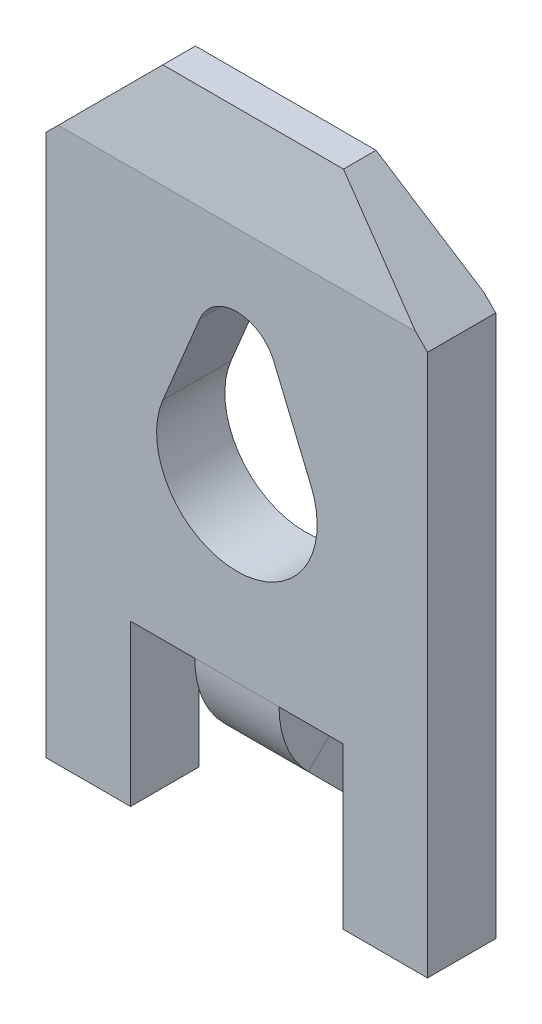
ISO-10303-21;
HEADER;
FILE_DESCRIPTION(('STEP AP214'),'2;1');
FILE_NAME('part.step','',(''),(''),'','','');
FILE_SCHEMA(('AUTOMOTIVE_DESIGN { 1 0 10303 214 1 1 1 1 }'));
ENDSEC;
DATA;
#1=APPLICATION_CONTEXT('core data for automotive mechanical design processes');
#2=APPLICATION_PROTOCOL_DEFINITION('international standard','automotive_design',2000,#1);
#3=PRODUCT_CONTEXT('',#1,'mechanical');
#4=PRODUCT('Part','Part','',(#3));
#5=PRODUCT_RELATED_PRODUCT_CATEGORY('part','',(#4));
#6=PRODUCT_DEFINITION_FORMATION('','',#4);
#7=PRODUCT_DEFINITION_CONTEXT('part definition',#1,'design');
#8=PRODUCT_DEFINITION('design','',#6,#7);
#9=PRODUCT_DEFINITION_SHAPE('','',#8);
#10=(LENGTH_UNIT() NAMED_UNIT(*) SI_UNIT(.MILLI.,.METRE.));
#11=(NAMED_UNIT(*) PLANE_ANGLE_UNIT() SI_UNIT($,.RADIAN.));
#12=(NAMED_UNIT(*) SI_UNIT($,.STERADIAN.) SOLID_ANGLE_UNIT());
#13=UNCERTAINTY_MEASURE_WITH_UNIT(LENGTH_MEASURE(1.E-05),#10,'distance_accuracy_value','');
#14=(GEOMETRIC_REPRESENTATION_CONTEXT(3) GLOBAL_UNCERTAINTY_ASSIGNED_CONTEXT((#13)) GLOBAL_UNIT_ASSIGNED_CONTEXT((#10,
#11,#12)) REPRESENTATION_CONTEXT('',''));
#15=CARTESIAN_POINT('',(0.,0.,0.));
#16=DIRECTION('',(0.,0.,1.));
#17=DIRECTION('',(1.,0.,0.));
#18=AXIS2_PLACEMENT_3D('',#15,#16,#17);
#19=CARTESIAN_POINT('',(4.75,0.149999999999999,0.));
#20=DIRECTION('',(0.,0.,1.));
#21=DIRECTION('',(0.,-1.,0.));
#22=AXIS2_PLACEMENT_3D('',#19,#20,#21);
#23=PLANE('',#22);
#24=DIRECTION('',(0.384813689288076,-0.922994271128754,0.));
#25=VECTOR('',#24,1.);
#26=CARTESIAN_POINT('',(2.84243697464802,5.82748992853653,0.));
#27=LINE('',#26,#25);
#28=CARTESIAN_POINT('',(2.84243697464802,5.82748992853653,0.));
#29=VERTEX_POINT('',#28);
#30=CARTESIAN_POINT('',(3.29799427112875,4.73481368928808,0.));
#31=VERTEX_POINT('',#30);
#32=EDGE_CURVE('E273',#29,#31,#27,.T.);
#33=ORIENTED_EDGE('',*,*,#32,.F.);
#34=CARTESIAN_POINT('',(2.375,5.65,0.));
#35=DIRECTION('',(0.,0.,1.));
#36=DIRECTION('',(0.,-1.,0.));
#37=AXIS2_PLACEMENT_3D('',#34,#35,#36);
#38=CIRCLE('',#37,0.5);
#39=CARTESIAN_POINT('',(1.91346153846154,5.84230769230769,0.));
#40=VERTEX_POINT('',#39);
#41=EDGE_CURVE('E276',#40,#29,#38,.F.);
#42=ORIENTED_EDGE('',*,*,#41,.F.);
#43=DIRECTION('',(0.384615384615385,0.923076923076923,0.));
#44=VECTOR('',#43,1.);
#45=CARTESIAN_POINT('',(1.91346153846154,5.84230769230769,0.));
#46=LINE('',#45,#44);
#47=CARTESIAN_POINT('',(1.45192307692308,4.73461538461538,0.));
#48=VERTEX_POINT('',#47);
#49=EDGE_CURVE('E278',#48,#40,#46,.T.);
#50=ORIENTED_EDGE('',*,*,#49,.F.);
#51=CARTESIAN_POINT('',(2.375,4.35,0.));
#52=DIRECTION('',(0.,0.,1.));
#53=DIRECTION('',(0.,-1.,0.));
#54=AXIS2_PLACEMENT_3D('',#51,#52,#53);
#55=CIRCLE('',#54,1.);
#56=EDGE_CURVE('E270',#31,#48,#55,.F.);
#57=ORIENTED_EDGE('',*,*,#56,.F.);
#58=EDGE_LOOP('',(#33,#42,#50,#57));
#59=FACE_BOUND('',#58,.T.);
#60=DIRECTION('',(1.,0.,0.));
#61=VECTOR('',#60,1.);
#62=CARTESIAN_POINT('',(2.9,2.15,0.));
#63=LINE('',#62,#61);
#64=CARTESIAN_POINT('',(2.9,2.15,0.));
#65=VERTEX_POINT('',#64);
#66=CARTESIAN_POINT('',(3.7,2.15,0.));
#67=VERTEX_POINT('',#66);
#68=EDGE_CURVE('E238',#65,#67,#63,.T.);
#69=ORIENTED_EDGE('',*,*,#68,.F.);
#70=DIRECTION('',(-1.,0.,0.));
#71=VECTOR('',#70,1.);
#72=CARTESIAN_POINT('',(4.75,2.15,0.));
#73=LINE('',#72,#71);
#74=CARTESIAN_POINT('',(1.85,2.15,0.));
#75=VERTEX_POINT('',#74);
#76=EDGE_CURVE('E51',#65,#75,#73,.T.);
#77=ORIENTED_EDGE('',*,*,#76,.T.);
#78=DIRECTION('',(1.,0.,0.));
#79=VECTOR('',#78,1.);
#80=CARTESIAN_POINT('',(1.85,2.15,0.));
#81=LINE('',#80,#79);
#82=CARTESIAN_POINT('',(1.05,2.15,0.));
#83=VERTEX_POINT('',#82);
#84=EDGE_CURVE('E249',#83,#75,#81,.T.);
#85=ORIENTED_EDGE('',*,*,#84,.F.);
#86=DIRECTION('',(0.,1.,0.));
#87=VECTOR('',#86,1.);
#88=CARTESIAN_POINT('',(1.05,2.15,0.));
#89=LINE('',#88,#87);
#90=CARTESIAN_POINT('',(1.05,0.149999999999999,0.));
#91=VERTEX_POINT('',#90);
#92=EDGE_CURVE('E247',#91,#83,#89,.T.);
#93=ORIENTED_EDGE('',*,*,#92,.F.);
#94=DIRECTION('',(-1.,0.,0.));
#95=VECTOR('',#94,1.);
#96=CARTESIAN_POINT('',(4.75,0.149999999999999,0.));
#97=LINE('',#96,#95);
#98=CARTESIAN_POINT('',(0.,0.149999999999999,0.));
#99=VERTEX_POINT('',#98);
#100=EDGE_CURVE('E347',#91,#99,#97,.T.);
#101=ORIENTED_EDGE('',*,*,#100,.T.);
#102=DIRECTION('',(0.,1.,0.));
#103=VECTOR('',#102,1.);
#104=CARTESIAN_POINT('',(0.,0.149999999999999,0.));
#105=LINE('',#104,#103);
#106=CARTESIAN_POINT('',(0.,6.9,0.));
#107=VERTEX_POINT('',#106);
#108=EDGE_CURVE('E332',#99,#107,#105,.T.);
#109=ORIENTED_EDGE('',*,*,#108,.T.);
#110=DIRECTION('',(-0.707106781186548,-0.707106781186548,0.));
#111=VECTOR('',#110,1.);
#112=CARTESIAN_POINT('',(0.,6.9,0.));
#113=LINE('',#112,#111);
#114=CARTESIAN_POINT('',(0.15,7.05,0.));
#115=VERTEX_POINT('',#114);
#116=EDGE_CURVE('E306',#115,#107,#113,.T.);
#117=ORIENTED_EDGE('',*,*,#116,.F.);
#118=DIRECTION('',(-1.,0.,0.));
#119=VECTOR('',#118,1.);
#120=CARTESIAN_POINT('',(4.75,7.05,0.));
#121=LINE('',#120,#119);
#122=CARTESIAN_POINT('',(4.6,7.05,0.));
#123=VERTEX_POINT('',#122);
#124=EDGE_CURVE('E337',#123,#115,#121,.T.);
#125=ORIENTED_EDGE('',*,*,#124,.F.);
#126=DIRECTION('',(-0.707106781186548,0.707106781186548,0.));
#127=VECTOR('',#126,1.);
#128=CARTESIAN_POINT('',(3.5,8.15,0.));
#129=LINE('',#128,#127);
#130=CARTESIAN_POINT('',(4.75,6.9,0.));
#131=VERTEX_POINT('',#130);
#132=EDGE_CURVE('E302',#131,#123,#129,.T.);
#133=ORIENTED_EDGE('',*,*,#132,.F.);
#134=DIRECTION('',(0.,1.,0.));
#135=VECTOR('',#134,1.);
#136=CARTESIAN_POINT('',(4.75,0.149999999999999,0.));
#137=LINE('',#136,#135);
#138=CARTESIAN_POINT('',(4.75,0.149999999999999,0.));
#139=VERTEX_POINT('',#138);
#140=EDGE_CURVE('E334',#139,#131,#137,.T.);
#141=ORIENTED_EDGE('',*,*,#140,.F.);
#142=CARTESIAN_POINT('',(3.7,0.149999999999999,0.));
#143=VERTEX_POINT('',#142);
#144=EDGE_CURVE('E348',#139,#143,#97,.T.);
#145=ORIENTED_EDGE('',*,*,#144,.T.);
#146=DIRECTION('',(0.,-1.,0.));
#147=VECTOR('',#146,1.);
#148=CARTESIAN_POINT('',(3.7,2.15,0.));
#149=LINE('',#148,#147);
#150=EDGE_CURVE('E262',#67,#143,#149,.T.);
#151=ORIENTED_EDGE('',*,*,#150,.F.);
#152=EDGE_LOOP('',(#69,#77,#85,#93,#101,#109,#117,#125,#133,#141,#145,#151));
#153=FACE_BOUND('',#152,.T.);
#154=ADVANCED_FACE('F44',(#59,#153),#23,.F.);
#155=CARTESIAN_POINT('',(4.75,7.05,0.85));
#156=DIRECTION('',(0.,0.,-1.));
#157=DIRECTION('',(0.,1.,0.));
#158=AXIS2_PLACEMENT_3D('',#155,#156,#157);
#159=PLANE('',#158);
#160=DIRECTION('',(-0.384615384615385,-0.923076923076923,0.));
#161=VECTOR('',#160,1.);
#162=CARTESIAN_POINT('',(1.91346153846154,5.84230769230769,0.849999999999999));
#163=LINE('',#162,#161);
#164=CARTESIAN_POINT('',(1.91346153846154,5.84230769230769,0.85));
#165=VERTEX_POINT('',#164);
#166=CARTESIAN_POINT('',(1.45192307692308,4.73461538461538,0.849999999999999));
#167=VERTEX_POINT('',#166);
#168=EDGE_CURVE('E280',#165,#167,#163,.T.);
#169=ORIENTED_EDGE('',*,*,#168,.F.);
#170=CARTESIAN_POINT('',(2.375,5.65,0.849999999999999));
#171=DIRECTION('',(0.,0.,1.));
#172=DIRECTION('',(1.,0.,0.));
#173=AXIS2_PLACEMENT_3D('',#170,#171,#172);
#174=CIRCLE('',#173,0.5);
#175=CARTESIAN_POINT('',(2.84243697464802,5.82748992853653,0.849999999999999));
#176=VERTEX_POINT('',#175);
#177=EDGE_CURVE('E256',#176,#165,#174,.T.);
#178=ORIENTED_EDGE('',*,*,#177,.F.);
#179=DIRECTION('',(-0.384813689288076,0.922994271128754,0.));
#180=VECTOR('',#179,1.);
#181=CARTESIAN_POINT('',(2.84243697464802,5.82748992853653,0.849999999999999));
#182=LINE('',#181,#180);
#183=CARTESIAN_POINT('',(3.29799427112875,4.73481368928808,0.849999999999999));
#184=VERTEX_POINT('',#183);
#185=EDGE_CURVE('E286',#184,#176,#182,.T.);
#186=ORIENTED_EDGE('',*,*,#185,.F.);
#187=CARTESIAN_POINT('',(2.375,4.35,0.849999999999999));
#188=DIRECTION('',(0.,0.,1.));
#189=DIRECTION('',(1.,0.,0.));
#190=AXIS2_PLACEMENT_3D('',#187,#188,#189);
#191=CIRCLE('',#190,1.);
#192=EDGE_CURVE('E283',#167,#184,#191,.T.);
#193=ORIENTED_EDGE('',*,*,#192,.F.);
#194=EDGE_LOOP('',(#169,#178,#186,#193));
#195=FACE_BOUND('',#194,.T.);
#196=DIRECTION('',(-1.,0.,0.));
#197=VECTOR('',#196,1.);
#198=CARTESIAN_POINT('',(1.85,2.15,0.85));
#199=LINE('',#198,#197);
#200=CARTESIAN_POINT('',(1.85,2.15,0.85));
#201=VERTEX_POINT('',#200);
#202=CARTESIAN_POINT('',(1.05,2.15,0.85));
#203=VERTEX_POINT('',#202);
#204=EDGE_CURVE('E243',#201,#203,#199,.T.);
#205=ORIENTED_EDGE('',*,*,#204,.F.);
#206=DIRECTION('',(1.,0.,0.));
#207=VECTOR('',#206,1.);
#208=CARTESIAN_POINT('',(4.75,2.15,0.849999999999999));
#209=LINE('',#208,#207);
#210=CARTESIAN_POINT('',(2.9,2.15,0.849999999999999));
#211=VERTEX_POINT('',#210);
#212=EDGE_CURVE('E364',#201,#211,#209,.T.);
#213=ORIENTED_EDGE('',*,*,#212,.T.);
#214=DIRECTION('',(-1.,0.,0.));
#215=VECTOR('',#214,1.);
#216=CARTESIAN_POINT('',(2.9,2.15,0.85));
#217=LINE('',#216,#215);
#218=CARTESIAN_POINT('',(3.7,2.15,0.85));
#219=VERTEX_POINT('',#218);
#220=EDGE_CURVE('E250',#219,#211,#217,.T.);
#221=ORIENTED_EDGE('',*,*,#220,.F.);
#222=DIRECTION('',(0.,1.,0.));
#223=VECTOR('',#222,1.);
#224=CARTESIAN_POINT('',(3.7,2.15,0.85));
#225=LINE('',#224,#223);
#226=CARTESIAN_POINT('',(3.7,0.149999999999999,0.849999999999999));
#227=VERTEX_POINT('',#226);
#228=EDGE_CURVE('E257',#227,#219,#225,.T.);
#229=ORIENTED_EDGE('',*,*,#228,.F.);
#230=DIRECTION('',(-1.,0.,0.));
#231=VECTOR('',#230,1.);
#232=CARTESIAN_POINT('',(4.75,0.149999999999999,0.849999999999999));
#233=LINE('',#232,#231);
#234=CARTESIAN_POINT('',(4.75,0.149999999999999,0.849999999999999));
#235=VERTEX_POINT('',#234);
#236=EDGE_CURVE('E352',#235,#227,#233,.T.);
#237=ORIENTED_EDGE('',*,*,#236,.F.);
#238=DIRECTION('',(0.,-1.,0.));
#239=VECTOR('',#238,1.);
#240=CARTESIAN_POINT('',(4.75,7.05,0.85));
#241=LINE('',#240,#239);
#242=CARTESIAN_POINT('',(4.75,6.9,0.85));
#243=VERTEX_POINT('',#242);
#244=EDGE_CURVE('E329',#243,#235,#241,.T.);
#245=ORIENTED_EDGE('',*,*,#244,.F.);
#246=DIRECTION('',(0.707106781186548,-0.707106781186548,0.));
#247=VECTOR('',#246,1.);
#248=CARTESIAN_POINT('',(3.5,8.15,0.849999999999999));
#249=LINE('',#248,#247);
#250=CARTESIAN_POINT('',(4.6,7.05,0.849999999999999));
#251=VERTEX_POINT('',#250);
#252=EDGE_CURVE('E298',#251,#243,#249,.T.);
#253=ORIENTED_EDGE('',*,*,#252,.F.);
#254=DIRECTION('',(-1.,0.,0.));
#255=VECTOR('',#254,1.);
#256=CARTESIAN_POINT('',(4.75,7.05,0.85));
#257=LINE('',#256,#255);
#258=CARTESIAN_POINT('',(0.15,7.05,0.849999999999999));
#259=VERTEX_POINT('',#258);
#260=EDGE_CURVE('E355',#251,#259,#257,.T.);
#261=ORIENTED_EDGE('',*,*,#260,.T.);
#262=DIRECTION('',(0.707106781186547,0.707106781186548,0.));
#263=VECTOR('',#262,1.);
#264=CARTESIAN_POINT('',(0.,6.9,0.849999999999999));
#265=LINE('',#264,#263);
#266=CARTESIAN_POINT('',(0.,6.9,0.849999999999999));
#267=VERTEX_POINT('',#266);
#268=EDGE_CURVE('E299',#267,#259,#265,.T.);
#269=ORIENTED_EDGE('',*,*,#268,.F.);
#270=DIRECTION('',(0.,-1.,0.));
#271=VECTOR('',#270,1.);
#272=CARTESIAN_POINT('',(0.,7.05,0.85));
#273=LINE('',#272,#271);
#274=CARTESIAN_POINT('',(0.,0.149999999999999,0.849999999999999));
#275=VERTEX_POINT('',#274);
#276=EDGE_CURVE('E328',#267,#275,#273,.T.);
#277=ORIENTED_EDGE('',*,*,#276,.T.);
#278=CARTESIAN_POINT('',(1.05,0.149999999999999,0.849999999999999));
#279=VERTEX_POINT('',#278);
#280=EDGE_CURVE('E351',#279,#275,#233,.T.);
#281=ORIENTED_EDGE('',*,*,#280,.F.);
#282=DIRECTION('',(0.,-1.,0.));
#283=VECTOR('',#282,1.);
#284=CARTESIAN_POINT('',(1.05,2.15,0.85));
#285=LINE('',#284,#283);
#286=EDGE_CURVE('E245',#203,#279,#285,.T.);
#287=ORIENTED_EDGE('',*,*,#286,.F.);
#288=EDGE_LOOP('',(#205,#213,#221,#229,#237,#245,#253,#261,#269,#277,#281,#287));
#289=FACE_BOUND('',#288,.T.);
#290=ADVANCED_FACE('F384',(#195,#289),#159,.F.);
#291=CARTESIAN_POINT('',(4.75,0.149999999999999,0.));
#292=DIRECTION('',(0.,1.,0.));
#293=DIRECTION('',(0.,0.,1.));
#294=AXIS2_PLACEMENT_3D('',#291,#292,#293);
#295=PLANE('',#294);
#296=ORIENTED_EDGE('',*,*,#100,.F.);
#297=DIRECTION('',(0.,0.,-1.));
#298=VECTOR('',#297,1.);
#299=CARTESIAN_POINT('',(1.05,0.149999999999999,3.0040659228538));
#300=LINE('',#299,#298);
#301=EDGE_CURVE('E65',#279,#91,#300,.T.);
#302=ORIENTED_EDGE('',*,*,#301,.F.);
#303=ORIENTED_EDGE('',*,*,#280,.T.);
#304=DIRECTION('',(0.,0.,-1.));
#305=VECTOR('',#304,1.);
#306=CARTESIAN_POINT('',(0.,0.149999999999999,0.));
#307=LINE('',#306,#305);
#308=EDGE_CURVE('E340',#275,#99,#307,.T.);
#309=ORIENTED_EDGE('',*,*,#308,.T.);
#310=EDGE_LOOP('',(#296,#302,#303,#309));
#311=FACE_BOUND('',#310,.T.);
#312=ADVANCED_FACE('F419',(#311),#295,.F.);
#313=CARTESIAN_POINT('',(4.75,7.05,0.));
#314=DIRECTION('',(0.,-0.214348018272916,0.976757353216485));
#315=DIRECTION('',(0.,-0.976757353216485,-0.214348018272916));
#316=AXIS2_PLACEMENT_3D('',#313,#314,#315);
#317=PLANE('',#316);
#318=ORIENTED_EDGE('',*,*,#124,.T.);
#319=DIRECTION('',(0.698744344369524,0.698744344369524,0.153338457091523));
#320=VECTOR('',#319,1.);
#321=CARTESIAN_POINT('',(2.39592083042662,9.29592083042662,0.492864146468432));
#322=LINE('',#321,#320);
#323=CARTESIAN_POINT('',(1.25,8.15,0.241393442622949));
#324=VERTEX_POINT('',#323);
#325=EDGE_CURVE('E319',#115,#324,#322,.T.);
#326=ORIENTED_EDGE('',*,*,#325,.T.);
#327=DIRECTION('',(-1.,0.,0.));
#328=VECTOR('',#327,1.);
#329=CARTESIAN_POINT('',(4.75,8.15,0.241393442622949));
#330=LINE('',#329,#328);
#331=CARTESIAN_POINT('',(3.5,8.15,0.241393442622949));
#332=VERTEX_POINT('',#331);
#333=EDGE_CURVE('E361',#332,#324,#330,.T.);
#334=ORIENTED_EDGE('',*,*,#333,.F.);
#335=DIRECTION('',(0.698744344369524,-0.698744344369524,-0.153338457091523));
#336=VECTOR('',#335,1.);
#337=CARTESIAN_POINT('',(4.67323654881826,6.97676345118174,-0.0160716569500576));
#338=LINE('',#337,#336);
#339=EDGE_CURVE('E325',#332,#123,#338,.T.);
#340=ORIENTED_EDGE('',*,*,#339,.T.);
#341=EDGE_LOOP('',(#318,#326,#334,#340));
#342=FACE_BOUND('',#341,.T.);
#343=ADVANCED_FACE('F481',(#342),#317,.F.);
#344=CARTESIAN_POINT('',(4.75,8.15,0.241393442622949));
#345=DIRECTION('',(0.,-1.,0.));
#346=DIRECTION('',(0.,0.,-1.));
#347=AXIS2_PLACEMENT_3D('',#344,#345,#346);
#348=PLANE('',#347);
#349=ORIENTED_EDGE('',*,*,#333,.T.);
#350=DIRECTION('',(0.,0.,1.));
#351=VECTOR('',#350,1.);
#352=CARTESIAN_POINT('',(1.25,8.15,-1.76776695296637));
#353=LINE('',#352,#351);
#354=CARTESIAN_POINT('',(1.25,8.15,0.647131147540979));
#355=VERTEX_POINT('',#354);
#356=EDGE_CURVE('E303',#324,#355,#353,.T.);
#357=ORIENTED_EDGE('',*,*,#356,.T.);
#358=DIRECTION('',(-1.,0.,0.));
#359=VECTOR('',#358,1.);
#360=CARTESIAN_POINT('',(4.75,8.15,0.647131147540979));
#361=LINE('',#360,#359);
#362=CARTESIAN_POINT('',(3.5,8.15,0.647131147540979));
#363=VERTEX_POINT('',#362);
#364=EDGE_CURVE('E358',#363,#355,#361,.T.);
#365=ORIENTED_EDGE('',*,*,#364,.F.);
#366=DIRECTION('',(0.,0.,1.));
#367=VECTOR('',#366,1.);
#368=CARTESIAN_POINT('',(3.5,8.15,-1.76776695296637));
#369=LINE('',#368,#367);
#370=EDGE_CURVE('E311',#332,#363,#369,.T.);
#371=ORIENTED_EDGE('',*,*,#370,.F.);
#372=EDGE_LOOP('',(#349,#357,#365,#371));
#373=FACE_BOUND('',#372,.T.);
#374=ADVANCED_FACE('F477',(#373),#348,.F.);
#375=CARTESIAN_POINT('',(4.75,8.15,0.647131147540979));
#376=DIRECTION('',(0.,-0.181367589437408,-0.983415373838371));
#377=DIRECTION('',(0.,0.983415373838371,-0.181367589437408));
#378=AXIS2_PLACEMENT_3D('',#375,#376,#377);
#379=PLANE('',#378);
#380=ORIENTED_EDGE('',*,*,#364,.T.);
#381=DIRECTION('',(-0.70116968993079,-0.70116968993079,0.12931408215937));
#382=VECTOR('',#381,1.);
#383=CARTESIAN_POINT('',(2.97073626927174,9.87073626927174,0.329782245421185));
#384=LINE('',#383,#382);
#385=EDGE_CURVE('E309',#355,#259,#384,.T.);
#386=ORIENTED_EDGE('',*,*,#385,.T.);
#387=ORIENTED_EDGE('',*,*,#260,.F.);
#388=DIRECTION('',(-0.70116968993079,0.70116968993079,-0.12931408215937));
#389=VECTOR('',#388,1.);
#390=CARTESIAN_POINT('',(4.11454866759705,7.53545133240295,0.760470041155192));
#391=LINE('',#390,#389);
#392=EDGE_CURVE('E322',#251,#363,#391,.T.);
#393=ORIENTED_EDGE('',*,*,#392,.T.);
#394=EDGE_LOOP('',(#380,#386,#387,#393));
#395=FACE_BOUND('',#394,.T.);
#396=ADVANCED_FACE('F473',(#395),#379,.F.);
#397=ORIENTED_EDGE('',*,*,#236,.T.);
#398=DIRECTION('',(0.,0.,-1.));
#399=VECTOR('',#398,1.);
#400=CARTESIAN_POINT('',(3.7,0.149999999999999,3.0040659228538));
#401=LINE('',#400,#399);
#402=EDGE_CURVE('E259',#227,#143,#401,.T.);
#403=ORIENTED_EDGE('',*,*,#402,.T.);
#404=ORIENTED_EDGE('',*,*,#144,.F.);
#405=DIRECTION('',(0.,0.,-1.));
#406=VECTOR('',#405,1.);
#407=CARTESIAN_POINT('',(4.75,0.149999999999999,0.));
#408=LINE('',#407,#406);
#409=EDGE_CURVE('E331',#235,#139,#408,.T.);
#410=ORIENTED_EDGE('',*,*,#409,.F.);
#411=EDGE_LOOP('',(#397,#403,#404,#410));
#412=FACE_BOUND('',#411,.T.);
#413=ADVANCED_FACE('F466',(#412),#295,.F.);
#414=CARTESIAN_POINT('',(4.75,0.,0.));
#415=DIRECTION('',(1.,0.,0.));
#416=DIRECTION('',(0.,0.,-1.));
#417=AXIS2_PLACEMENT_3D('',#414,#415,#416);
#418=PLANE('',#417);
#419=DIRECTION('',(0.,0.,1.));
#420=VECTOR('',#419,1.);
#421=CARTESIAN_POINT('',(4.75,6.9,-1.76776695296637));
#422=LINE('',#421,#420);
#423=EDGE_CURVE('E312',#131,#243,#422,.T.);
#424=ORIENTED_EDGE('',*,*,#423,.T.);
#425=ORIENTED_EDGE('',*,*,#244,.T.);
#426=ORIENTED_EDGE('',*,*,#409,.T.);
#427=ORIENTED_EDGE('',*,*,#140,.T.);
#428=EDGE_LOOP('',(#424,#425,#426,#427));
#429=FACE_BOUND('',#428,.T.);
#430=ADVANCED_FACE('F463',(#429),#418,.T.);
#431=CARTESIAN_POINT('',(0.,0.,0.));
#432=DIRECTION('',(1.,0.,0.));
#433=DIRECTION('',(0.,0.,-1.));
#434=AXIS2_PLACEMENT_3D('',#431,#432,#433);
#435=PLANE('',#434);
#436=ORIENTED_EDGE('',*,*,#276,.F.);
#437=DIRECTION('',(0.,0.,1.));
#438=VECTOR('',#437,1.);
#439=CARTESIAN_POINT('',(0.,6.9,-1.76776695296637));
#440=LINE('',#439,#438);
#441=EDGE_CURVE('E301',#107,#267,#440,.T.);
#442=ORIENTED_EDGE('',*,*,#441,.F.);
#443=ORIENTED_EDGE('',*,*,#108,.F.);
#444=ORIENTED_EDGE('',*,*,#308,.F.);
#445=EDGE_LOOP('',(#436,#442,#443,#444));
#446=FACE_BOUND('',#445,.T.);
#447=ADVANCED_FACE('F458',(#446),#435,.F.);
#448=CARTESIAN_POINT('',(0.,6.9,-1.76776695296637));
#449=DIRECTION('',(0.707106781186548,-0.707106781186548,0.));
#450=DIRECTION('',(0.707106781186548,0.707106781186548,0.));
#451=AXIS2_PLACEMENT_3D('',#448,#449,#450);
#452=PLANE('',#451);
#453=ORIENTED_EDGE('',*,*,#116,.T.);
#454=ORIENTED_EDGE('',*,*,#441,.T.);
#455=ORIENTED_EDGE('',*,*,#268,.T.);
#456=ORIENTED_EDGE('',*,*,#385,.F.);
#457=ORIENTED_EDGE('',*,*,#356,.F.);
#458=ORIENTED_EDGE('',*,*,#325,.F.);
#459=EDGE_LOOP('',(#453,#454,#455,#456,#457,#458));
#460=FACE_BOUND('',#459,.T.);
#461=ADVANCED_FACE('F455',(#460),#452,.F.);
#462=CARTESIAN_POINT('',(3.5,8.15,-1.76776695296637));
#463=DIRECTION('',(-0.707106781186547,-0.707106781186547,0.));
#464=DIRECTION('',(0.707106781186548,-0.707106781186548,0.));
#465=AXIS2_PLACEMENT_3D('',#462,#463,#464);
#466=PLANE('',#465);
#467=ORIENTED_EDGE('',*,*,#370,.T.);
#468=ORIENTED_EDGE('',*,*,#392,.F.);
#469=ORIENTED_EDGE('',*,*,#252,.T.);
#470=ORIENTED_EDGE('',*,*,#423,.F.);
#471=ORIENTED_EDGE('',*,*,#132,.T.);
#472=ORIENTED_EDGE('',*,*,#339,.F.);
#473=EDGE_LOOP('',(#467,#468,#469,#470,#471,#472));
#474=FACE_BOUND('',#473,.T.);
#475=ADVANCED_FACE('F454',(#474),#466,.F.);
#476=CARTESIAN_POINT('',(2.375,5.65,-3.44093010681705));
#477=DIRECTION('',(0.,0.,1.));
#478=DIRECTION('',(1.,0.,0.));
#479=AXIS2_PLACEMENT_3D('',#476,#477,#478);
#480=CYLINDRICAL_SURFACE('',#479,0.5);
#481=ORIENTED_EDGE('',*,*,#41,.T.);
#482=DIRECTION('',(0.,0.,1.));
#483=VECTOR('',#482,1.);
#484=CARTESIAN_POINT('',(2.84243697464802,5.82748992853653,-3.44093010681705));
#485=LINE('',#484,#483);
#486=EDGE_CURVE('E274',#29,#176,#485,.T.);
#487=ORIENTED_EDGE('',*,*,#486,.T.);
#488=ORIENTED_EDGE('',*,*,#177,.T.);
#489=DIRECTION('',(0.,0.,1.));
#490=VECTOR('',#489,1.);
#491=CARTESIAN_POINT('',(1.91346153846154,5.84230769230769,-3.44093010681705));
#492=LINE('',#491,#490);
#493=EDGE_CURVE('E289',#40,#165,#492,.T.);
#494=ORIENTED_EDGE('',*,*,#493,.F.);
#495=EDGE_LOOP('',(#481,#487,#488,#494));
#496=FACE_BOUND('',#495,.T.);
#497=ADVANCED_FACE('F437',(#496),#480,.F.);
#498=CARTESIAN_POINT('',(2.84243697464802,5.82748992853653,-3.44093010681705));
#499=DIRECTION('',(0.922994271128754,0.384813689288076,0.));
#500=DIRECTION('',(-0.384813689288076,0.922994271128754,0.));
#501=AXIS2_PLACEMENT_3D('',#498,#499,#500);
#502=PLANE('',#501);
#503=ORIENTED_EDGE('',*,*,#32,.T.);
#504=DIRECTION('',(0.,0.,1.));
#505=VECTOR('',#504,1.);
#506=CARTESIAN_POINT('',(3.29799427112875,4.73481368928808,-3.44093010681705));
#507=LINE('',#506,#505);
#508=EDGE_CURVE('E291',#31,#184,#507,.T.);
#509=ORIENTED_EDGE('',*,*,#508,.T.);
#510=ORIENTED_EDGE('',*,*,#185,.T.);
#511=ORIENTED_EDGE('',*,*,#486,.F.);
#512=EDGE_LOOP('',(#503,#509,#510,#511));
#513=FACE_BOUND('',#512,.T.);
#514=ADVANCED_FACE('F428',(#513),#502,.F.);
#515=CARTESIAN_POINT('',(2.375,4.35,-3.44093010681705));
#516=DIRECTION('',(0.,0.,1.));
#517=DIRECTION('',(1.,0.,0.));
#518=AXIS2_PLACEMENT_3D('',#515,#516,#517);
#519=CYLINDRICAL_SURFACE('',#518,1.);
#520=ORIENTED_EDGE('',*,*,#56,.T.);
#521=DIRECTION('',(0.,0.,1.));
#522=VECTOR('',#521,1.);
#523=CARTESIAN_POINT('',(1.45192307692308,4.73461538461538,-3.44093010681705));
#524=LINE('',#523,#522);
#525=EDGE_CURVE('E293',#48,#167,#524,.T.);
#526=ORIENTED_EDGE('',*,*,#525,.T.);
#527=ORIENTED_EDGE('',*,*,#192,.T.);
#528=ORIENTED_EDGE('',*,*,#508,.F.);
#529=EDGE_LOOP('',(#520,#526,#527,#528));
#530=FACE_BOUND('',#529,.T.);
#531=ADVANCED_FACE('F430',(#530),#519,.F.);
#532=CARTESIAN_POINT('',(1.91346153846154,5.84230769230769,-3.44093010681705));
#533=DIRECTION('',(-0.923076923076923,0.384615384615385,0.));
#534=DIRECTION('',(-0.384615384615385,-0.923076923076923,0.));
#535=AXIS2_PLACEMENT_3D('',#532,#533,#534);
#536=PLANE('',#535);
#537=ORIENTED_EDGE('',*,*,#49,.T.);
#538=ORIENTED_EDGE('',*,*,#493,.T.);
#539=ORIENTED_EDGE('',*,*,#168,.T.);
#540=ORIENTED_EDGE('',*,*,#525,.F.);
#541=EDGE_LOOP('',(#537,#538,#539,#540));
#542=FACE_BOUND('',#541,.T.);
#543=ADVANCED_FACE('F439',(#542),#536,.F.);
#544=CARTESIAN_POINT('',(3.7,2.15,3.0040659228538));
#545=DIRECTION('',(1.,0.,0.));
#546=DIRECTION('',(0.,1.,0.));
#547=AXIS2_PLACEMENT_3D('',#544,#545,#546);
#548=PLANE('',#547);
#549=ORIENTED_EDGE('',*,*,#228,.T.);
#550=DIRECTION('',(0.,0.,-1.));
#551=VECTOR('',#550,1.);
#552=CARTESIAN_POINT('',(3.7,2.15,3.0040659228538));
#553=LINE('',#552,#551);
#554=EDGE_CURVE('E264',#219,#67,#553,.T.);
#555=ORIENTED_EDGE('',*,*,#554,.T.);
#556=ORIENTED_EDGE('',*,*,#150,.T.);
#557=ORIENTED_EDGE('',*,*,#402,.F.);
#558=EDGE_LOOP('',(#549,#555,#556,#557));
#559=FACE_BOUND('',#558,.T.);
#560=ADVANCED_FACE('F441',(#559),#548,.F.);
#561=CARTESIAN_POINT('',(2.9,2.15,3.0040659228538));
#562=DIRECTION('',(0.,1.,0.));
#563=DIRECTION('',(-1.,0.,0.));
#564=AXIS2_PLACEMENT_3D('',#561,#562,#563);
#565=PLANE('',#564);
#566=ORIENTED_EDGE('',*,*,#220,.T.);
#567=DIRECTION('',(0.,0.,-1.));
#568=VECTOR('',#567,1.);
#569=CARTESIAN_POINT('',(2.9,2.15,3.0040659228538));
#570=LINE('',#569,#568);
#571=EDGE_CURVE('E12',#211,#65,#570,.T.);
#572=ORIENTED_EDGE('',*,*,#571,.T.);
#573=ORIENTED_EDGE('',*,*,#68,.T.);
#574=ORIENTED_EDGE('',*,*,#554,.F.);
#575=EDGE_LOOP('',(#566,#572,#573,#574));
#576=FACE_BOUND('',#575,.T.);
#577=ADVANCED_FACE('F374',(#576),#565,.F.);
#578=CARTESIAN_POINT('',(1.85,2.15,3.0040659228538));
#579=DIRECTION('',(0.,1.,0.));
#580=DIRECTION('',(0.,0.,1.));
#581=AXIS2_PLACEMENT_3D('',#578,#579,#580);
#582=PLANE('',#581);
#583=ORIENTED_EDGE('',*,*,#204,.T.);
#584=DIRECTION('',(0.,0.,-1.));
#585=VECTOR('',#584,1.);
#586=CARTESIAN_POINT('',(1.05,2.15,3.0040659228538));
#587=LINE('',#586,#585);
#588=EDGE_CURVE('E246',#203,#83,#587,.T.);
#589=ORIENTED_EDGE('',*,*,#588,.T.);
#590=ORIENTED_EDGE('',*,*,#84,.T.);
#591=DIRECTION('',(0.,0.,-1.));
#592=VECTOR('',#591,1.);
#593=CARTESIAN_POINT('',(1.85,2.15,3.0040659228538));
#594=LINE('',#593,#592);
#595=EDGE_CURVE('E367',#201,#75,#594,.T.);
#596=ORIENTED_EDGE('',*,*,#595,.F.);
#597=EDGE_LOOP('',(#583,#589,#590,#596));
#598=FACE_BOUND('',#597,.T.);
#599=ADVANCED_FACE('F391',(#598),#582,.F.);
#600=CARTESIAN_POINT('',(1.05,2.15,3.0040659228538));
#601=DIRECTION('',(-1.,0.,0.));
#602=DIRECTION('',(0.,-1.,0.));
#603=AXIS2_PLACEMENT_3D('',#600,#601,#602);
#604=PLANE('',#603);
#605=ORIENTED_EDGE('',*,*,#286,.T.);
#606=ORIENTED_EDGE('',*,*,#301,.T.);
#607=ORIENTED_EDGE('',*,*,#92,.T.);
#608=ORIENTED_EDGE('',*,*,#588,.F.);
#609=EDGE_LOOP('',(#605,#606,#607,#608));
#610=FACE_BOUND('',#609,.T.);
#611=ADVANCED_FACE('F508',(#610),#604,.F.);
#612=CARTESIAN_POINT('',(1.85,2.15,-0.400000000000001));
#613=DIRECTION('',(-1.,0.,0.));
#614=DIRECTION('',(0.,0.,1.));
#615=AXIS2_PLACEMENT_3D('',#612,#613,#614);
#616=PLANE('',#615);
#617=ORIENTED_EDGE('',*,*,#595,.T.);
#618=CARTESIAN_POINT('',(1.85,2.15,-0.400000000000001));
#619=DIRECTION('',(1.,0.,0.));
#620=DIRECTION('',(0.,1.,0.));
#621=AXIS2_PLACEMENT_3D('',#618,#619,#620);
#622=CIRCLE('',#621,0.4);
#623=CARTESIAN_POINT('',(1.85,1.86715728752538,-0.117157287525382));
#624=VERTEX_POINT('',#623);
#625=EDGE_CURVE('E240',#75,#624,#622,.T.);
#626=ORIENTED_EDGE('',*,*,#625,.T.);
#627=DIRECTION('',(0.,-0.707106781186554,0.707106781186541));
#628=VECTOR('',#627,1.);
#629=CARTESIAN_POINT('',(1.85,-0.257038097655978,2.00703809765595));
#630=LINE('',#629,#628);
#631=CARTESIAN_POINT('',(1.85,1.26611652351682,0.483883476483182));
#632=VERTEX_POINT('',#631);
#633=EDGE_CURVE('E219',#624,#632,#630,.T.);
#634=ORIENTED_EDGE('',*,*,#633,.T.);
#635=CARTESIAN_POINT('',(1.85,2.15,-0.400000000000001));
#636=DIRECTION('',(1.,0.,0.));
#637=DIRECTION('',(0.,0.,1.));
#638=AXIS2_PLACEMENT_3D('',#635,#636,#637);
#639=CIRCLE('',#638,1.25);
#640=EDGE_CURVE('E231',#201,#632,#639,.T.);
#641=ORIENTED_EDGE('',*,*,#640,.F.);
#642=EDGE_LOOP('',(#617,#626,#634,#641));
#643=FACE_BOUND('',#642,.T.);
#644=ADVANCED_FACE('F393',(#643),#616,.T.);
#645=CARTESIAN_POINT('',(2.9,2.15,-0.400000000000001));
#646=DIRECTION('',(1.,0.,0.));
#647=DIRECTION('',(0.,0.,-1.));
#648=AXIS2_PLACEMENT_3D('',#645,#646,#647);
#649=PLANE('',#648);
#650=DIRECTION('',(0.,0.707106781186554,-0.707106781186541));
#651=VECTOR('',#650,1.);
#652=CARTESIAN_POINT('',(2.9,-0.257038097655979,2.00703809765595));
#653=LINE('',#652,#651);
#654=CARTESIAN_POINT('',(2.9,1.26611652351682,0.483883476483185));
#655=VERTEX_POINT('',#654);
#656=CARTESIAN_POINT('',(2.9,1.86715728752538,-0.117157287525382));
#657=VERTEX_POINT('',#656);
#658=EDGE_CURVE('E200',#655,#657,#653,.T.);
#659=ORIENTED_EDGE('',*,*,#658,.T.);
#660=CARTESIAN_POINT('',(2.9,2.15,-0.400000000000001));
#661=DIRECTION('',(1.,0.,0.));
#662=DIRECTION('',(0.,1.,0.));
#663=AXIS2_PLACEMENT_3D('',#660,#661,#662);
#664=CIRCLE('',#663,0.4);
#665=EDGE_CURVE('E235',#657,#65,#664,.F.);
#666=ORIENTED_EDGE('',*,*,#665,.T.);
#667=ORIENTED_EDGE('',*,*,#571,.F.);
#668=CARTESIAN_POINT('',(2.9,2.15,-0.400000000000001));
#669=DIRECTION('',(-1.,0.,0.));
#670=DIRECTION('',(0.,0.,-1.));
#671=AXIS2_PLACEMENT_3D('',#668,#669,#670);
#672=CIRCLE('',#671,1.25);
#673=EDGE_CURVE('E234',#655,#211,#672,.T.);
#674=ORIENTED_EDGE('',*,*,#673,.F.);
#675=EDGE_LOOP('',(#659,#666,#667,#674));
#676=FACE_BOUND('',#675,.T.);
#677=ADVANCED_FACE('F378',(#676),#649,.T.);
#678=CARTESIAN_POINT('',(0.876719746353102,2.15,-0.400000000000001));
#679=DIRECTION('',(1.,0.,0.));
#680=DIRECTION('',(0.,1.,0.));
#681=AXIS2_PLACEMENT_3D('',#678,#679,#680);
#682=CYLINDRICAL_SURFACE('',#681,1.25);
#683=ORIENTED_EDGE('',*,*,#673,.T.);
#684=ORIENTED_EDGE('',*,*,#212,.F.);
#685=ORIENTED_EDGE('',*,*,#640,.T.);
#686=DIRECTION('',(1.,0.,0.));
#687=VECTOR('',#686,1.);
#688=CARTESIAN_POINT('',(4.75,1.26611652351681,0.48388347648318));
#689=LINE('',#688,#687);
#690=EDGE_CURVE('E229',#632,#655,#689,.T.);
#691=ORIENTED_EDGE('',*,*,#690,.T.);
#692=EDGE_LOOP('',(#683,#684,#685,#691));
#693=FACE_BOUND('',#692,.T.);
#694=ADVANCED_FACE('F381',(#693),#682,.T.);
#695=CARTESIAN_POINT('',(0.876719746353102,2.15,-0.400000000000001));
#696=DIRECTION('',(1.,0.,0.));
#697=DIRECTION('',(0.,1.,0.));
#698=AXIS2_PLACEMENT_3D('',#695,#696,#697);
#699=CYLINDRICAL_SURFACE('',#698,0.4);
#700=ORIENTED_EDGE('',*,*,#665,.F.);
#701=DIRECTION('',(-1.,0.,0.));
#702=VECTOR('',#701,1.);
#703=CARTESIAN_POINT('',(4.75,1.86715728752538,-0.11715728752538));
#704=LINE('',#703,#702);
#705=EDGE_CURVE('E222',#657,#624,#704,.T.);
#706=ORIENTED_EDGE('',*,*,#705,.T.);
#707=ORIENTED_EDGE('',*,*,#625,.F.);
#708=ORIENTED_EDGE('',*,*,#76,.F.);
#709=EDGE_LOOP('',(#700,#706,#707,#708));
#710=FACE_BOUND('',#709,.T.);
#711=ADVANCED_FACE('F394',(#710),#699,.F.);
#712=CARTESIAN_POINT('',(0.,0.204009246963323,-1.78030532808745));
#713=DIRECTION('',(0.,-0.707106781186546,-0.707106781186549));
#714=DIRECTION('',(0.,0.707106781186549,-0.707106781186546));
#715=AXIS2_PLACEMENT_3D('',#712,#713,#714);
#716=PLANE('',#715);
#717=DIRECTION('',(0.,-0.707106781186549,0.707106781186546));
#718=VECTOR('',#717,1.);
#719=CARTESIAN_POINT('',(2.9,0.204009246963323,-1.78030532808745));
#720=LINE('',#719,#718);
#721=CARTESIAN_POINT('',(2.9,0.204009246963323,-1.78030532808745));
#722=VERTEX_POINT('',#721);
#723=CARTESIAN_POINT('',(2.9,-0.397031517045243,-1.17926456407888));
#724=VERTEX_POINT('',#723);
#725=EDGE_CURVE('E198',#722,#724,#720,.T.);
#726=ORIENTED_EDGE('',*,*,#725,.T.);
#727=DIRECTION('',(-1.,0.,0.));
#728=VECTOR('',#727,1.);
#729=CARTESIAN_POINT('',(2.9,-0.397031517045243,-1.17926456407888));
#730=LINE('',#729,#728);
#731=CARTESIAN_POINT('',(1.85,-0.397031517045243,-1.17926456407888));
#732=VERTEX_POINT('',#731);
#733=EDGE_CURVE('E207',#724,#732,#730,.T.);
#734=ORIENTED_EDGE('',*,*,#733,.T.);
#735=DIRECTION('',(0.,0.707106781186549,-0.707106781186546));
#736=VECTOR('',#735,1.);
#737=CARTESIAN_POINT('',(1.85,-0.397031517045243,-1.17926456407888));
#738=LINE('',#737,#736);
#739=CARTESIAN_POINT('',(1.85,0.204009246963323,-1.78030532808745));
#740=VERTEX_POINT('',#739);
#741=EDGE_CURVE('E213',#732,#740,#738,.T.);
#742=ORIENTED_EDGE('',*,*,#741,.T.);
#743=DIRECTION('',(1.,0.,0.));
#744=VECTOR('',#743,1.);
#745=CARTESIAN_POINT('',(1.85,0.204009246963323,-1.78030532808745));
#746=LINE('',#745,#744);
#747=EDGE_CURVE('E218',#740,#722,#746,.T.);
#748=ORIENTED_EDGE('',*,*,#747,.T.);
#749=EDGE_LOOP('',(#726,#734,#742,#748));
#750=FACE_BOUND('',#749,.T.);
#751=ADVANCED_FACE('F216',(#750),#716,.T.);
#752=CARTESIAN_POINT('',(4.75,5.18911205432847,4.40687900729485));
#753=DIRECTION('',(0.,0.707106781186549,-0.707106781186546));
#754=DIRECTION('',(0.,0.707106781186546,0.707106781186549));
#755=AXIS2_PLACEMENT_3D('',#752,#753,#754);
#756=PLANE('',#755);
#757=ORIENTED_EDGE('',*,*,#690,.F.);
#758=DIRECTION('',(0.,0.707106781186546,0.707106781186549));
#759=VECTOR('',#758,1.);
#760=CARTESIAN_POINT('',(1.85,1.7242888265144,0.942055779480764));
#761=LINE('',#760,#759);
#762=EDGE_CURVE('E204',#732,#632,#761,.T.);
#763=ORIENTED_EDGE('',*,*,#762,.F.);
#764=ORIENTED_EDGE('',*,*,#733,.F.);
#765=DIRECTION('',(0.,-0.707106781186546,-0.707106781186549));
#766=VECTOR('',#765,1.);
#767=CARTESIAN_POINT('',(2.9,1.7242888265144,0.942055779480764));
#768=LINE('',#767,#766);
#769=EDGE_CURVE('E194',#655,#724,#768,.T.);
#770=ORIENTED_EDGE('',*,*,#769,.F.);
#771=EDGE_LOOP('',(#757,#763,#764,#770));
#772=FACE_BOUND('',#771,.T.);
#773=ADVANCED_FACE('F208',(#772),#756,.F.);
#774=CARTESIAN_POINT('',(1.85,0.201134205341611,2.46521040065354));
#775=DIRECTION('',(1.,0.,0.));
#776=DIRECTION('',(0.,0.707106781186546,0.707106781186549));
#777=AXIS2_PLACEMENT_3D('',#774,#775,#776);
#778=PLANE('',#777);
#779=ORIENTED_EDGE('',*,*,#633,.F.);
#780=DIRECTION('',(0.,-0.707106781186546,-0.707106781186549));
#781=VECTOR('',#780,1.);
#782=CARTESIAN_POINT('',(1.85,2.32532959052296,0.3410150154722));
#783=LINE('',#782,#781);
#784=EDGE_CURVE('E398',#624,#740,#783,.T.);
#785=ORIENTED_EDGE('',*,*,#784,.T.);
#786=ORIENTED_EDGE('',*,*,#741,.F.);
#787=ORIENTED_EDGE('',*,*,#762,.T.);
#788=EDGE_LOOP('',(#779,#785,#786,#787));
#789=FACE_BOUND('',#788,.T.);
#790=ADVANCED_FACE('F402',(#789),#778,.F.);
#791=CARTESIAN_POINT('',(4.75,0.911116028149869,-1.0731985469009));
#792=DIRECTION('',(0.,-0.707106781186549,0.707106781186546));
#793=DIRECTION('',(0.,-0.707106781186546,-0.707106781186549));
#794=AXIS2_PLACEMENT_3D('',#791,#792,#793);
#795=PLANE('',#794);
#796=ORIENTED_EDGE('',*,*,#705,.F.);
#797=DIRECTION('',(0.,0.707106781186546,0.707106781186549));
#798=VECTOR('',#797,1.);
#799=CARTESIAN_POINT('',(2.9,2.32532959052296,0.3410150154722));
#800=LINE('',#799,#798);
#801=EDGE_CURVE('E203',#722,#657,#800,.T.);
#802=ORIENTED_EDGE('',*,*,#801,.F.);
#803=ORIENTED_EDGE('',*,*,#747,.F.);
#804=ORIENTED_EDGE('',*,*,#784,.F.);
#805=EDGE_LOOP('',(#796,#802,#803,#804));
#806=FACE_BOUND('',#805,.T.);
#807=ADVANCED_FACE('F397',(#806),#795,.F.);
#808=CARTESIAN_POINT('',(2.9,0.201134205341611,2.46521040065354));
#809=DIRECTION('',(-1.,0.,0.));
#810=DIRECTION('',(0.,-0.707106781186546,-0.707106781186549));
#811=AXIS2_PLACEMENT_3D('',#808,#809,#810);
#812=PLANE('',#811);
#813=ORIENTED_EDGE('',*,*,#658,.F.);
#814=ORIENTED_EDGE('',*,*,#769,.T.);
#815=ORIENTED_EDGE('',*,*,#725,.F.);
#816=ORIENTED_EDGE('',*,*,#801,.T.);
#817=EDGE_LOOP('',(#813,#814,#815,#816));
#818=FACE_BOUND('',#817,.T.);
#819=ADVANCED_FACE('F196',(#818),#812,.F.);
#820=CLOSED_SHELL('',(#154,#290,#312,#343,#374,#396,#413,#430,#447,#461,#475,#497,#514,#531,
#543,#560,#577,#599,#611,#644,#677,#694,#711,#751,#773,#790,#807,#819));
#821=MANIFOLD_SOLID_BREP('B2',#820);
#822=ADVANCED_BREP_SHAPE_REPRESENTATION('',(#18,#821),#14);
#823=SHAPE_DEFINITION_REPRESENTATION(#9,#822);
ENDSEC;
END-ISO-10303-21;
